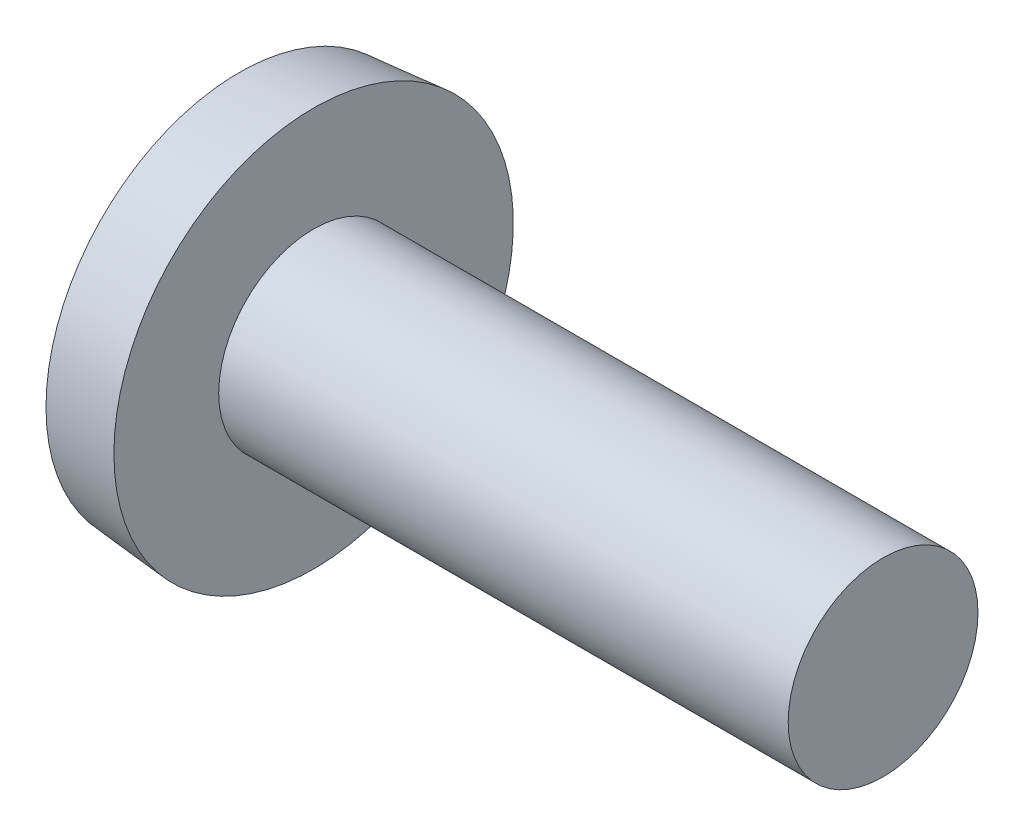
ISO-10303-21;
HEADER;
FILE_DESCRIPTION(('STEP AP214'),'2;1');
FILE_NAME('part.step','',(''),(''),'','','');
FILE_SCHEMA(('AUTOMOTIVE_DESIGN { 1 0 10303 214 1 1 1 1 }'));
ENDSEC;
DATA;
#1=APPLICATION_CONTEXT('core data for automotive mechanical design processes');
#2=APPLICATION_PROTOCOL_DEFINITION('international standard','automotive_design',2000,#1);
#3=PRODUCT_CONTEXT('',#1,'mechanical');
#4=PRODUCT('Part','Part','',(#3));
#5=PRODUCT_RELATED_PRODUCT_CATEGORY('part','',(#4));
#6=PRODUCT_DEFINITION_FORMATION('','',#4);
#7=PRODUCT_DEFINITION_CONTEXT('part definition',#1,'design');
#8=PRODUCT_DEFINITION('design','',#6,#7);
#9=PRODUCT_DEFINITION_SHAPE('','',#8);
#10=(LENGTH_UNIT() NAMED_UNIT(*) SI_UNIT(.MILLI.,.METRE.));
#11=(NAMED_UNIT(*) PLANE_ANGLE_UNIT() SI_UNIT($,.RADIAN.));
#12=(NAMED_UNIT(*) SI_UNIT($,.STERADIAN.) SOLID_ANGLE_UNIT());
#13=UNCERTAINTY_MEASURE_WITH_UNIT(LENGTH_MEASURE(1.E-05),#10,'distance_accuracy_value','');
#14=(GEOMETRIC_REPRESENTATION_CONTEXT(3) GLOBAL_UNCERTAINTY_ASSIGNED_CONTEXT((#13)) GLOBAL_UNIT_ASSIGNED_CONTEXT((#10,
#11,#12)) REPRESENTATION_CONTEXT('',''));
#15=CARTESIAN_POINT('',(0.,0.,0.));
#16=DIRECTION('',(0.,0.,1.));
#17=DIRECTION('',(1.,0.,0.));
#18=AXIS2_PLACEMENT_3D('',#15,#16,#17);
#19=CARTESIAN_POINT('',(7.45540865093937,0.,0.));
#20=DIRECTION('',(-1.,0.,0.));
#21=DIRECTION('',(0.,1.,0.));
#22=AXIS2_PLACEMENT_3D('',#19,#20,#21);
#23=SPHERICAL_SURFACE('',#22,7.45540865093937);
#24=CARTESIAN_POINT('',(0.7366,0.,0.));
#25=DIRECTION('',(-1.,0.,0.));
#26=DIRECTION('',(0.,0.,1.));
#27=AXIS2_PLACEMENT_3D('',#24,#25,#26);
#28=CIRCLE('',#27,3.23121160937563);
#29=CARTESIAN_POINT('',(0.7366,0.,3.23121160937563));
#30=VERTEX_POINT('',#29);
#31=EDGE_CURVE('E152',#30,#30,#28,.T.);
#32=ORIENTED_EDGE('',*,*,#31,.T.);
#33=EDGE_LOOP('',(#32));
#34=FACE_BOUND('',#33,.T.);
#35=CARTESIAN_POINT('',(7.43469231632645,0.,-0.225577865785082));
#36=DIRECTION('',(-0.091451892445728,0.,-0.99580949552015));
#37=DIRECTION('',(-0.99580949552015,0.,0.091451892445728));
#38=AXIS2_PLACEMENT_3D('',#35,#36,#37);
#39=CIRCLE('',#38,7.45196642588046);
#40=CARTESIAN_POINT('',(0.277056144298769,1.96671302947954,0.431756068380725));
#41=VERTEX_POINT('',#40);
#42=CARTESIAN_POINT('',(0.0277773533899879,0.454649018566225,0.454649018566225));
#43=VERTEX_POINT('',#42);
#44=EDGE_CURVE('E123',#41,#43,#39,.F.);
#45=ORIENTED_EDGE('',*,*,#44,.T.);
#46=CARTESIAN_POINT('',(7.43469231632645,-0.225577865785084,0.));
#47=DIRECTION('',(-0.0914518924457283,-0.99580949552015,0.));
#48=DIRECTION('',(0.99580949552015,-0.0914518924457283,0.));
#49=AXIS2_PLACEMENT_3D('',#46,#47,#48);
#50=CIRCLE('',#49,7.45196642588046);
#51=CARTESIAN_POINT('',(0.277056144298769,0.431756068380719,1.96671302947954));
#52=VERTEX_POINT('',#51);
#53=EDGE_CURVE('E104',#43,#52,#50,.F.);
#54=ORIENTED_EDGE('',*,*,#53,.T.);
#55=CARTESIAN_POINT('',(5.67084446556503,0.,-2.27126350865824));
#56=DIRECTION('',(0.617821551931904,0.,0.786318338822423));
#57=DIRECTION('',(0.786318338822423,0.,-0.617821551931904));
#58=AXIS2_PLACEMENT_3D('',#55,#56,#57);
#59=CIRCLE('',#58,6.87312235414286);
#60=CARTESIAN_POINT('',(0.277056144298768,-0.431756068380732,1.96671302947954));
#61=VERTEX_POINT('',#60);
#62=EDGE_CURVE('E115',#61,#52,#59,.F.);
#63=ORIENTED_EDGE('',*,*,#62,.F.);
#64=CARTESIAN_POINT('',(7.43469231632645,0.225577865785082,0.));
#65=DIRECTION('',(-0.091451892445728,0.99580949552015,0.));
#66=DIRECTION('',(-0.99580949552015,-0.091451892445728,0.));
#67=AXIS2_PLACEMENT_3D('',#64,#65,#66);
#68=CIRCLE('',#67,7.45196642588046);
#69=CARTESIAN_POINT('',(0.0277773533899871,-0.454649018566227,0.454649018566225));
#70=VERTEX_POINT('',#69);
#71=EDGE_CURVE('E190',#61,#70,#68,.F.);
#72=ORIENTED_EDGE('',*,*,#71,.T.);
#73=CARTESIAN_POINT('',(0.277056144298766,-1.96671302947954,0.431756068380725));
#74=VERTEX_POINT('',#73);
#75=EDGE_CURVE('E160',#70,#74,#39,.F.);
#76=ORIENTED_EDGE('',*,*,#75,.T.);
#77=CARTESIAN_POINT('',(5.67084446556503,2.27126350865824,0.));
#78=DIRECTION('',(0.617821551931904,-0.786318338822423,0.));
#79=DIRECTION('',(0.786318338822423,0.617821551931904,0.));
#80=AXIS2_PLACEMENT_3D('',#77,#78,#79);
#81=CIRCLE('',#80,6.87312235414286);
#82=CARTESIAN_POINT('',(0.277056144298766,-1.96671302947954,-0.431756068380727));
#83=VERTEX_POINT('',#82);
#84=EDGE_CURVE('E158',#83,#74,#81,.F.);
#85=ORIENTED_EDGE('',*,*,#84,.F.);
#86=CARTESIAN_POINT('',(7.43469231632645,0.,0.225577865785084));
#87=DIRECTION('',(-0.0914518924457283,0.,0.99580949552015));
#88=DIRECTION('',(0.99580949552015,0.,0.0914518924457283));
#89=AXIS2_PLACEMENT_3D('',#86,#87,#88);
#90=CIRCLE('',#89,7.45196642588046);
#91=CARTESIAN_POINT('',(0.0277773533899862,-0.454649018566224,-0.454649018566227));
#92=VERTEX_POINT('',#91);
#93=EDGE_CURVE('E162',#83,#92,#90,.F.);
#94=ORIENTED_EDGE('',*,*,#93,.T.);
#95=CARTESIAN_POINT('',(0.277056144298767,-0.431756068380718,-1.96671302947954));
#96=VERTEX_POINT('',#95);
#97=EDGE_CURVE('E188',#92,#96,#68,.F.);
#98=ORIENTED_EDGE('',*,*,#97,.T.);
#99=CARTESIAN_POINT('',(5.67084446556503,0.,2.27126350865824));
#100=DIRECTION('',(0.617821551931904,0.,-0.786318338822423));
#101=DIRECTION('',(-0.786318338822423,0.,-0.617821551931904));
#102=AXIS2_PLACEMENT_3D('',#99,#100,#101);
#103=CIRCLE('',#102,6.87312235414286);
#104=CARTESIAN_POINT('',(0.277056144298767,0.431756068380733,-1.96671302947954));
#105=VERTEX_POINT('',#104);
#106=EDGE_CURVE('E116',#105,#96,#103,.F.);
#107=ORIENTED_EDGE('',*,*,#106,.F.);
#108=CARTESIAN_POINT('',(0.0277773533899871,0.454649018566228,-0.454649018566227));
#109=VERTEX_POINT('',#108);
#110=EDGE_CURVE('E139',#105,#109,#50,.F.);
#111=ORIENTED_EDGE('',*,*,#110,.T.);
#112=CARTESIAN_POINT('',(0.277056144298769,1.96671302947954,-0.431756068380726));
#113=VERTEX_POINT('',#112);
#114=EDGE_CURVE('E55',#109,#113,#90,.F.);
#115=ORIENTED_EDGE('',*,*,#114,.T.);
#116=CARTESIAN_POINT('',(5.67084446556504,-2.27126350865824,0.));
#117=DIRECTION('',(0.617821551931904,0.786318338822423,0.));
#118=DIRECTION('',(-0.786318338822423,0.617821551931904,0.));
#119=AXIS2_PLACEMENT_3D('',#116,#117,#118);
#120=CIRCLE('',#119,6.87312235414286);
#121=EDGE_CURVE('E40',#41,#113,#120,.F.);
#122=ORIENTED_EDGE('',*,*,#121,.F.);
#123=EDGE_LOOP('',(#45,#54,#63,#72,#76,#85,#94,#98,#107,#111,#115,#122));
#124=FACE_BOUND('',#123,.T.);
#125=ADVANCED_FACE('F32',(#34,#124),#23,.T.);
#126=CARTESIAN_POINT('',(2.78014545454545,0.,-0.20188051948052));
#127=DIRECTION('',(-0.0914518924457283,0.,0.99580949552015));
#128=DIRECTION('',(0.99580949552015,0.,0.0914518924457283));
#129=AXIS2_PLACEMENT_3D('',#126,#127,#128);
#130=PLANE('',#129);
#131=ORIENTED_EDGE('',*,*,#114,.F.);
#132=DIRECTION('',(0.991671234323886,-0.0910718480501534,0.0910718480501531));
#133=VECTOR('',#132,1.);
#134=CARTESIAN_POINT('',(2.79837795691918,0.200206105997219,-0.200206105997218));
#135=LINE('',#134,#133);
#136=CARTESIAN_POINT('',(2.4892,0.228600000000001,-0.228599999999999));
#137=VERTEX_POINT('',#136);
#138=EDGE_CURVE('E141',#109,#137,#135,.T.);
#139=ORIENTED_EDGE('',*,*,#138,.T.);
#140=DIRECTION('',(0.78427611379664,-0.616216946554503,0.0720253573894875));
#141=VECTOR('',#140,1.);
#142=CARTESIAN_POINT('',(0.,2.1844,-0.4572));
#143=LINE('',#142,#141);
#144=EDGE_CURVE('E125',#113,#137,#143,.T.);
#145=ORIENTED_EDGE('',*,*,#144,.F.);
#146=EDGE_LOOP('',(#131,#139,#145));
#147=FACE_BOUND('',#146,.T.);
#148=ADVANCED_FACE('F166',(#147),#130,.T.);
#149=DIRECTION('',(0.78427611379664,0.616216946554503,0.0720253573894877));
#150=VECTOR('',#149,1.);
#151=CARTESIAN_POINT('',(0.,-2.1844,-0.457200000000001));
#152=LINE('',#151,#150);
#153=CARTESIAN_POINT('',(2.4892,-0.2286,-0.2286));
#154=VERTEX_POINT('',#153);
#155=EDGE_CURVE('E47',#83,#154,#152,.T.);
#156=ORIENTED_EDGE('',*,*,#155,.T.);
#157=DIRECTION('',(-0.991671234323886,-0.0910718480501525,-0.0910718480501531));
#158=VECTOR('',#157,1.);
#159=CARTESIAN_POINT('',(2.79837795691918,-0.200206105997217,-0.200206105997218));
#160=LINE('',#159,#158);
#161=EDGE_CURVE('E186',#154,#92,#160,.T.);
#162=ORIENTED_EDGE('',*,*,#161,.T.);
#163=ORIENTED_EDGE('',*,*,#93,.F.);
#164=EDGE_LOOP('',(#156,#162,#163));
#165=FACE_BOUND('',#164,.T.);
#166=ADVANCED_FACE('F192',(#165),#130,.T.);
#167=CARTESIAN_POINT('',(2.78014545454545,0.,0.201880519480519));
#168=DIRECTION('',(-0.091451892445728,0.,-0.99580949552015));
#169=DIRECTION('',(-0.99580949552015,0.,0.091451892445728));
#170=AXIS2_PLACEMENT_3D('',#167,#168,#169);
#171=PLANE('',#170);
#172=DIRECTION('',(0.78427611379664,-0.616216946554503,-0.0720253573894874));
#173=VECTOR('',#172,1.);
#174=CARTESIAN_POINT('',(0.,2.1844,0.4572));
#175=LINE('',#174,#173);
#176=CARTESIAN_POINT('',(2.4892,0.228599999999999,0.228600000000001));
#177=VERTEX_POINT('',#176);
#178=EDGE_CURVE('E120',#41,#177,#175,.T.);
#179=ORIENTED_EDGE('',*,*,#178,.T.);
#180=DIRECTION('',(-0.991671234323886,0.0910718480501528,0.0910718480501528));
#181=VECTOR('',#180,1.);
#182=CARTESIAN_POINT('',(2.79837795691918,0.200206105997217,0.200206105997218));
#183=LINE('',#182,#181);
#184=EDGE_CURVE('E11',#177,#43,#183,.T.);
#185=ORIENTED_EDGE('',*,*,#184,.T.);
#186=ORIENTED_EDGE('',*,*,#44,.F.);
#187=EDGE_LOOP('',(#179,#185,#186));
#188=FACE_BOUND('',#187,.T.);
#189=ADVANCED_FACE('F122',(#188),#171,.T.);
#190=ORIENTED_EDGE('',*,*,#75,.F.);
#191=DIRECTION('',(0.991671234323886,0.0910718480501531,-0.0910718480501528));
#192=VECTOR('',#191,1.);
#193=CARTESIAN_POINT('',(2.79837795691918,-0.200206105997219,0.200206105997218));
#194=LINE('',#193,#192);
#195=CARTESIAN_POINT('',(2.4892,-0.2286,0.2286));
#196=VERTEX_POINT('',#195);
#197=EDGE_CURVE('E200',#70,#196,#194,.T.);
#198=ORIENTED_EDGE('',*,*,#197,.T.);
#199=DIRECTION('',(0.78427611379664,0.616216946554503,-0.0720253573894874));
#200=VECTOR('',#199,1.);
#201=CARTESIAN_POINT('',(0.,-2.1844,0.4572));
#202=LINE('',#201,#200);
#203=EDGE_CURVE('E171',#74,#196,#202,.T.);
#204=ORIENTED_EDGE('',*,*,#203,.F.);
#205=EDGE_LOOP('',(#190,#198,#204));
#206=FACE_BOUND('',#205,.T.);
#207=ADVANCED_FACE('F199',(#206),#171,.T.);
#208=CARTESIAN_POINT('',(-25.4,0.,0.));
#209=DIRECTION('',(-1.,0.,0.));
#210=DIRECTION('',(0.,0.,1.));
#211=AXIS2_PLACEMENT_3D('',#208,#209,#210);
#212=CYLINDRICAL_SURFACE('',#211,1.5875);
#213=CARTESIAN_POINT('',(11.5062,0.,0.));
#214=DIRECTION('',(-1.,0.,0.));
#215=DIRECTION('',(0.,0.,1.));
#216=AXIS2_PLACEMENT_3D('',#213,#214,#215);
#217=CIRCLE('',#216,1.5875);
#218=CARTESIAN_POINT('',(11.5062,0.,1.5875));
#219=VERTEX_POINT('',#218);
#220=EDGE_CURVE('E155',#219,#219,#217,.T.);
#221=ORIENTED_EDGE('',*,*,#220,.T.);
#222=EDGE_LOOP('',(#221));
#223=FACE_BOUND('',#222,.T.);
#224=CARTESIAN_POINT('',(1.9812,0.,0.));
#225=DIRECTION('',(-1.,0.,0.));
#226=DIRECTION('',(0.,0.,1.));
#227=AXIS2_PLACEMENT_3D('',#224,#225,#226);
#228=CIRCLE('',#227,1.5875);
#229=CARTESIAN_POINT('',(1.9812,0.,1.5875));
#230=VERTEX_POINT('',#229);
#231=EDGE_CURVE('E146',#230,#230,#228,.T.);
#232=ORIENTED_EDGE('',*,*,#231,.F.);
#233=EDGE_LOOP('',(#232));
#234=FACE_BOUND('',#233,.T.);
#235=ADVANCED_FACE('F34',(#223,#234),#212,.T.);
#236=CARTESIAN_POINT('',(11.5062,1.5875,0.));
#237=DIRECTION('',(1.,0.,0.));
#238=DIRECTION('',(0.,0.,-1.));
#239=AXIS2_PLACEMENT_3D('',#236,#237,#238);
#240=PLANE('',#239);
#241=ORIENTED_EDGE('',*,*,#220,.F.);
#242=EDGE_LOOP('',(#241));
#243=FACE_BOUND('',#242,.T.);
#244=ADVANCED_FACE('F231',(#243),#240,.T.);
#245=CARTESIAN_POINT('',(1.9812,0.,0.));
#246=DIRECTION('',(1.,0.,0.));
#247=DIRECTION('',(0.,0.,-1.));
#248=AXIS2_PLACEMENT_3D('',#245,#246,#247);
#249=CONICAL_SURFACE('',#248,3.3401,0.0872664625997221);
#250=ORIENTED_EDGE('',*,*,#31,.F.);
#251=EDGE_LOOP('',(#250));
#252=FACE_BOUND('',#251,.T.);
#253=CARTESIAN_POINT('',(1.9812,0.,0.));
#254=DIRECTION('',(-1.,0.,0.));
#255=DIRECTION('',(0.,0.,1.));
#256=AXIS2_PLACEMENT_3D('',#253,#254,#255);
#257=CIRCLE('',#256,3.3401);
#258=CARTESIAN_POINT('',(1.9812,0.,3.3401));
#259=VERTEX_POINT('',#258);
#260=EDGE_CURVE('E149',#259,#259,#257,.T.);
#261=ORIENTED_EDGE('',*,*,#260,.T.);
#262=EDGE_LOOP('',(#261));
#263=FACE_BOUND('',#262,.T.);
#264=ADVANCED_FACE('F229',(#252,#263),#249,.T.);
#265=CARTESIAN_POINT('',(1.9812,1.5875,0.));
#266=DIRECTION('',(-1.,0.,0.));
#267=DIRECTION('',(0.,0.,1.));
#268=AXIS2_PLACEMENT_3D('',#265,#266,#267);
#269=PLANE('',#268);
#270=ORIENTED_EDGE('',*,*,#260,.F.);
#271=EDGE_LOOP('',(#270));
#272=FACE_BOUND('',#271,.T.);
#273=ORIENTED_EDGE('',*,*,#231,.T.);
#274=EDGE_LOOP('',(#273));
#275=FACE_BOUND('',#274,.T.);
#276=ADVANCED_FACE('F238',(#272,#275),#269,.F.);
#277=CARTESIAN_POINT('',(2.4892,0.2286,0.2286));
#278=DIRECTION('',(-1.,0.,0.));
#279=DIRECTION('',(0.,0.,1.));
#280=AXIS2_PLACEMENT_3D('',#277,#278,#279);
#281=PLANE('',#280);
#282=DIRECTION('',(0.,1.,0.));
#283=VECTOR('',#282,1.);
#284=CARTESIAN_POINT('',(2.4892,-0.2286,0.2286));
#285=LINE('',#284,#283);
#286=EDGE_CURVE('E112',#196,#177,#285,.T.);
#287=ORIENTED_EDGE('',*,*,#286,.T.);
#288=DIRECTION('',(0.,0.,-1.));
#289=VECTOR('',#288,1.);
#290=CARTESIAN_POINT('',(2.4892,0.2286,0.2286));
#291=LINE('',#290,#289);
#292=EDGE_CURVE('E129',#177,#137,#291,.T.);
#293=ORIENTED_EDGE('',*,*,#292,.T.);
#294=DIRECTION('',(0.,-1.,0.));
#295=VECTOR('',#294,1.);
#296=CARTESIAN_POINT('',(2.4892,0.2286,-0.2286));
#297=LINE('',#296,#295);
#298=EDGE_CURVE('E134',#137,#154,#297,.T.);
#299=ORIENTED_EDGE('',*,*,#298,.T.);
#300=DIRECTION('',(0.,0.,1.));
#301=VECTOR('',#300,1.);
#302=CARTESIAN_POINT('',(2.4892,-0.2286,-0.2286));
#303=LINE('',#302,#301);
#304=EDGE_CURVE('E138',#154,#196,#303,.T.);
#305=ORIENTED_EDGE('',*,*,#304,.T.);
#306=EDGE_LOOP('',(#287,#293,#299,#305));
#307=FACE_BOUND('',#306,.T.);
#308=ADVANCED_FACE('F137',(#307),#281,.T.);
#309=CARTESIAN_POINT('',(2.4892,0.2286,0.2286));
#310=DIRECTION('',(0.617821551931904,0.786318338822423,0.));
#311=DIRECTION('',(-0.786318338822423,0.617821551931904,0.));
#312=AXIS2_PLACEMENT_3D('',#309,#310,#311);
#313=PLANE('',#312);
#314=ORIENTED_EDGE('',*,*,#121,.T.);
#315=ORIENTED_EDGE('',*,*,#144,.T.);
#316=ORIENTED_EDGE('',*,*,#292,.F.);
#317=ORIENTED_EDGE('',*,*,#178,.F.);
#318=EDGE_LOOP('',(#314,#315,#316,#317));
#319=FACE_BOUND('',#318,.T.);
#320=ADVANCED_FACE('F130',(#319),#313,.F.);
#321=CARTESIAN_POINT('',(2.4892,-0.2286,-0.2286));
#322=DIRECTION('',(0.617821551931904,-0.786318338822423,0.));
#323=DIRECTION('',(0.786318338822423,0.617821551931904,0.));
#324=AXIS2_PLACEMENT_3D('',#321,#322,#323);
#325=PLANE('',#324);
#326=ORIENTED_EDGE('',*,*,#84,.T.);
#327=ORIENTED_EDGE('',*,*,#203,.T.);
#328=ORIENTED_EDGE('',*,*,#304,.F.);
#329=ORIENTED_EDGE('',*,*,#155,.F.);
#330=EDGE_LOOP('',(#326,#327,#328,#329));
#331=FACE_BOUND('',#330,.T.);
#332=ADVANCED_FACE('F194',(#331),#325,.F.);
#333=CARTESIAN_POINT('',(2.78014545454545,0.20188051948052,0.));
#334=DIRECTION('',(-0.0914518924457283,-0.99580949552015,0.));
#335=DIRECTION('',(0.99580949552015,-0.0914518924457283,0.));
#336=AXIS2_PLACEMENT_3D('',#333,#334,#335);
#337=PLANE('',#336);
#338=ORIENTED_EDGE('',*,*,#184,.F.);
#339=DIRECTION('',(0.78427611379664,-0.0720253573894854,-0.616216946554504));
#340=VECTOR('',#339,1.);
#341=CARTESIAN_POINT('',(0.,0.457199999999993,2.1844));
#342=LINE('',#341,#340);
#343=EDGE_CURVE('E102',#52,#177,#342,.T.);
#344=ORIENTED_EDGE('',*,*,#343,.F.);
#345=ORIENTED_EDGE('',*,*,#53,.F.);
#346=EDGE_LOOP('',(#338,#344,#345));
#347=FACE_BOUND('',#346,.T.);
#348=ADVANCED_FACE('F101',(#347),#337,.T.);
#349=CARTESIAN_POINT('',(2.78014545454545,-0.201880519480519,0.));
#350=DIRECTION('',(-0.091451892445728,0.99580949552015,0.));
#351=DIRECTION('',(-0.99580949552015,-0.091451892445728,0.));
#352=AXIS2_PLACEMENT_3D('',#349,#350,#351);
#353=PLANE('',#352);
#354=DIRECTION('',(0.78427611379664,0.0720253573894895,-0.616216946554503));
#355=VECTOR('',#354,1.);
#356=CARTESIAN_POINT('',(0.,-0.457200000000007,2.1844));
#357=LINE('',#356,#355);
#358=EDGE_CURVE('E117',#61,#196,#357,.T.);
#359=ORIENTED_EDGE('',*,*,#358,.T.);
#360=ORIENTED_EDGE('',*,*,#197,.F.);
#361=ORIENTED_EDGE('',*,*,#71,.F.);
#362=EDGE_LOOP('',(#359,#360,#361));
#363=FACE_BOUND('',#362,.T.);
#364=ADVANCED_FACE('F207',(#363),#353,.T.);
#365=CARTESIAN_POINT('',(2.4892,-0.228600000000001,0.228599999999999));
#366=DIRECTION('',(0.617821551931904,0.,0.786318338822423));
#367=DIRECTION('',(-0.786318338822423,0.,0.617821551931904));
#368=AXIS2_PLACEMENT_3D('',#365,#366,#367);
#369=PLANE('',#368);
#370=ORIENTED_EDGE('',*,*,#62,.T.);
#371=ORIENTED_EDGE('',*,*,#343,.T.);
#372=ORIENTED_EDGE('',*,*,#286,.F.);
#373=ORIENTED_EDGE('',*,*,#358,.F.);
#374=EDGE_LOOP('',(#370,#371,#372,#373));
#375=FACE_BOUND('',#374,.T.);
#376=ADVANCED_FACE('F109',(#375),#369,.F.);
#377=DIRECTION('',(0.78427611379664,-0.0720253573894899,0.616216946554503));
#378=VECTOR('',#377,1.);
#379=CARTESIAN_POINT('',(0.,0.457200000000009,-2.1844));
#380=LINE('',#379,#378);
#381=EDGE_CURVE('E177',#105,#137,#380,.T.);
#382=ORIENTED_EDGE('',*,*,#381,.T.);
#383=ORIENTED_EDGE('',*,*,#138,.F.);
#384=ORIENTED_EDGE('',*,*,#110,.F.);
#385=EDGE_LOOP('',(#382,#383,#384));
#386=FACE_BOUND('',#385,.T.);
#387=ADVANCED_FACE('F211',(#386),#337,.T.);
#388=ORIENTED_EDGE('',*,*,#161,.F.);
#389=DIRECTION('',(0.78427611379664,0.0720253573894852,0.616216946554503));
#390=VECTOR('',#389,1.);
#391=CARTESIAN_POINT('',(0.,-0.457199999999992,-2.1844));
#392=LINE('',#391,#390);
#393=EDGE_CURVE('E180',#96,#154,#392,.T.);
#394=ORIENTED_EDGE('',*,*,#393,.F.);
#395=ORIENTED_EDGE('',*,*,#97,.F.);
#396=EDGE_LOOP('',(#388,#394,#395));
#397=FACE_BOUND('',#396,.T.);
#398=ADVANCED_FACE('F187',(#397),#353,.T.);
#399=CARTESIAN_POINT('',(2.4892,0.228600000000001,-0.228599999999999));
#400=DIRECTION('',(0.617821551931904,0.,-0.786318338822423));
#401=DIRECTION('',(0.786318338822423,0.,0.617821551931904));
#402=AXIS2_PLACEMENT_3D('',#399,#400,#401);
#403=PLANE('',#402);
#404=ORIENTED_EDGE('',*,*,#106,.T.);
#405=ORIENTED_EDGE('',*,*,#393,.T.);
#406=ORIENTED_EDGE('',*,*,#298,.F.);
#407=ORIENTED_EDGE('',*,*,#381,.F.);
#408=EDGE_LOOP('',(#404,#405,#406,#407));
#409=FACE_BOUND('',#408,.T.);
#410=ADVANCED_FACE('F176',(#409),#403,.F.);
#411=CLOSED_SHELL('',(#125,#148,#166,#189,#207,#235,#244,#264,#276,#308,#320,#332,#348,#364,
#376,#387,#398,#410));
#412=MANIFOLD_SOLID_BREP('B2',#411);
#413=ADVANCED_BREP_SHAPE_REPRESENTATION('',(#18,#412),#14);
#414=SHAPE_DEFINITION_REPRESENTATION(#9,#413);
ENDSEC;
END-ISO-10303-21;
